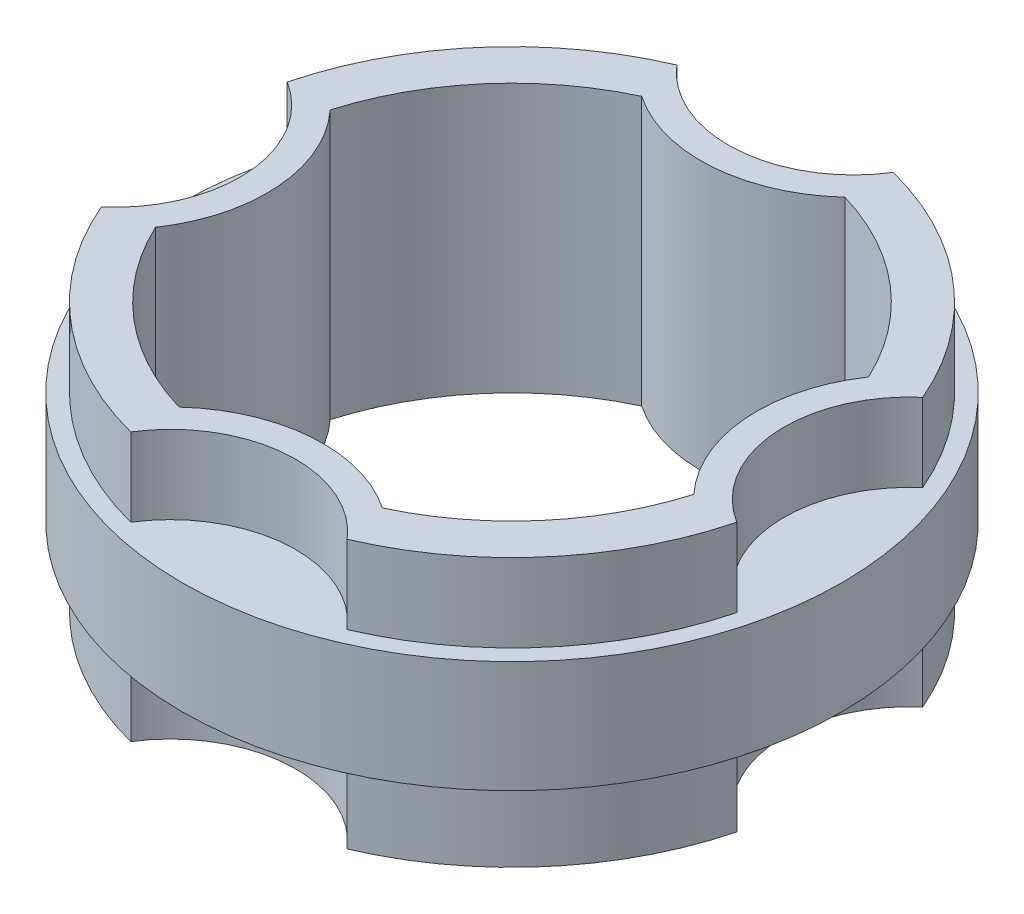
ISO-10303-21;
HEADER;
FILE_DESCRIPTION(('STEP AP214'),'2;1');
FILE_NAME('part.step','',(''),(''),'','','');
FILE_SCHEMA(('AUTOMOTIVE_DESIGN { 1 0 10303 214 1 1 1 1 }'));
ENDSEC;
DATA;
#1=APPLICATION_CONTEXT('core data for automotive mechanical design processes');
#2=APPLICATION_PROTOCOL_DEFINITION('international standard','automotive_design',2000,#1);
#3=PRODUCT_CONTEXT('',#1,'mechanical');
#4=PRODUCT('Part','Part','',(#3));
#5=PRODUCT_RELATED_PRODUCT_CATEGORY('part','',(#4));
#6=PRODUCT_DEFINITION_FORMATION('','',#4);
#7=PRODUCT_DEFINITION_CONTEXT('part definition',#1,'design');
#8=PRODUCT_DEFINITION('design','',#6,#7);
#9=PRODUCT_DEFINITION_SHAPE('','',#8);
#10=(LENGTH_UNIT() NAMED_UNIT(*) SI_UNIT(.MILLI.,.METRE.));
#11=(NAMED_UNIT(*) PLANE_ANGLE_UNIT() SI_UNIT($,.RADIAN.));
#12=(NAMED_UNIT(*) SI_UNIT($,.STERADIAN.) SOLID_ANGLE_UNIT());
#13=UNCERTAINTY_MEASURE_WITH_UNIT(LENGTH_MEASURE(1.E-05),#10,'distance_accuracy_value','');
#14=(GEOMETRIC_REPRESENTATION_CONTEXT(3) GLOBAL_UNCERTAINTY_ASSIGNED_CONTEXT((#13)) GLOBAL_UNIT_ASSIGNED_CONTEXT((#10,
#11,#12)) REPRESENTATION_CONTEXT('',''));
#15=CARTESIAN_POINT('',(0.,0.,0.));
#16=DIRECTION('',(0.,0.,1.));
#17=DIRECTION('',(1.,0.,0.));
#18=AXIS2_PLACEMENT_3D('',#15,#16,#17);
#19=CARTESIAN_POINT('',(104.92721593541,-44.5241872410913,-7.94005837170104));
#20=DIRECTION('',(0.,1.,0.));
#21=DIRECTION('',(0.,0.,1.));
#22=AXIS2_PLACEMENT_3D('',#19,#20,#21);
#23=CYLINDRICAL_SURFACE('',#22,35.5704838142581);
#24=CARTESIAN_POINT('',(104.92721593541,15.875,-7.94005837170104));
#25=DIRECTION('',(0.,1.,0.));
#26=DIRECTION('',(0.,0.,1.));
#27=AXIS2_PLACEMENT_3D('',#24,#25,#26);
#28=CIRCLE('',#27,35.5704838142581);
#29=CARTESIAN_POINT('',(86.0770548694598,15.875,22.225));
#30=VERTEX_POINT('',#29);
#31=CARTESIAN_POINT('',(81.7523967538567,15.875,-34.925));
#32=VERTEX_POINT('',#31);
#33=EDGE_CURVE('E330',#30,#32,#28,.F.);
#34=ORIENTED_EDGE('',*,*,#33,.T.);
#35=DIRECTION('',(0.,1.,0.));
#36=VECTOR('',#35,1.);
#37=CARTESIAN_POINT('',(81.7523967538567,-44.5241872410913,-34.925));
#38=LINE('',#37,#36);
#39=CARTESIAN_POINT('',(81.7523967538567,38.1,-34.925));
#40=VERTEX_POINT('',#39);
#41=EDGE_CURVE('E283',#32,#40,#38,.T.);
#42=ORIENTED_EDGE('',*,*,#41,.T.);
#43=CARTESIAN_POINT('',(104.92721593541,38.1,-7.94005837170104));
#44=DIRECTION('',(0.,1.,0.));
#45=DIRECTION('',(0.,0.,1.));
#46=AXIS2_PLACEMENT_3D('',#43,#44,#45);
#47=CIRCLE('',#46,35.5704838142581);
#48=CARTESIAN_POINT('',(86.0770548694598,38.1,22.225));
#49=VERTEX_POINT('',#48);
#50=EDGE_CURVE('E286',#40,#49,#47,.T.);
#51=ORIENTED_EDGE('',*,*,#50,.T.);
#52=DIRECTION('',(0.,1.,0.));
#53=VECTOR('',#52,1.);
#54=CARTESIAN_POINT('',(86.0770548694598,-44.5241872410913,22.225));
#55=LINE('',#54,#53);
#56=EDGE_CURVE('E280',#30,#49,#55,.T.);
#57=ORIENTED_EDGE('',*,*,#56,.F.);
#58=EDGE_LOOP('',(#34,#42,#51,#57));
#59=FACE_BOUND('',#58,.T.);
#60=ADVANCED_FACE('F39',(#59),#23,.F.);
#61=DIRECTION('',(0.,-1.,0.));
#62=VECTOR('',#61,1.);
#63=CARTESIAN_POINT('',(81.7523967538567,76.2741872410913,-34.925));
#64=LINE('',#63,#62);
#65=CARTESIAN_POINT('',(81.7523967538567,-15.875,-34.925));
#66=VERTEX_POINT('',#65);
#67=CARTESIAN_POINT('',(81.7523967538567,-38.1,-34.925));
#68=VERTEX_POINT('',#67);
#69=EDGE_CURVE('E366',#66,#68,#64,.T.);
#70=ORIENTED_EDGE('',*,*,#69,.F.);
#71=CARTESIAN_POINT('',(104.92721593541,-15.875,-7.94005837170104));
#72=DIRECTION('',(0.,1.,0.));
#73=DIRECTION('',(0.,0.,1.));
#74=AXIS2_PLACEMENT_3D('',#71,#72,#73);
#75=CIRCLE('',#74,35.5704838142581);
#76=CARTESIAN_POINT('',(86.0770548694598,-15.875,22.225));
#77=VERTEX_POINT('',#76);
#78=EDGE_CURVE('E384',#77,#66,#75,.F.);
#79=ORIENTED_EDGE('',*,*,#78,.F.);
#80=DIRECTION('',(0.,-1.,0.));
#81=VECTOR('',#80,1.);
#82=CARTESIAN_POINT('',(86.0770548694598,76.2741872410913,22.225));
#83=LINE('',#82,#81);
#84=CARTESIAN_POINT('',(86.0770548694598,-38.1,22.225));
#85=VERTEX_POINT('',#84);
#86=EDGE_CURVE('E362',#77,#85,#83,.T.);
#87=ORIENTED_EDGE('',*,*,#86,.T.);
#88=CARTESIAN_POINT('',(104.92721593541,-38.1,-7.94005837170104));
#89=DIRECTION('',(0.,1.,0.));
#90=DIRECTION('',(0.,0.,1.));
#91=AXIS2_PLACEMENT_3D('',#88,#89,#90);
#92=CIRCLE('',#91,35.5704838142581);
#93=EDGE_CURVE('E304',#68,#85,#92,.T.);
#94=ORIENTED_EDGE('',*,*,#93,.F.);
#95=EDGE_LOOP('',(#70,#79,#87,#94));
#96=FACE_BOUND('',#95,.T.);
#97=ADVANCED_FACE('F466',(#96),#23,.F.);
#98=CARTESIAN_POINT('',(-7.94005837169994,-44.5241872410913,-104.92721593541));
#99=DIRECTION('',(0.,1.,0.));
#100=DIRECTION('',(0.,0.,1.));
#101=AXIS2_PLACEMENT_3D('',#98,#99,#100);
#102=CYLINDRICAL_SURFACE('',#101,35.5704838142581);
#103=CARTESIAN_POINT('',(-7.94005837169994,15.875,-104.92721593541));
#104=DIRECTION('',(0.,1.,0.));
#105=DIRECTION('',(0.,0.,1.));
#106=AXIS2_PLACEMENT_3D('',#103,#104,#105);
#107=CIRCLE('',#106,35.5704838142581);
#108=CARTESIAN_POINT('',(22.2250000000009,15.875,-86.0770548694596));
#109=VERTEX_POINT('',#108);
#110=CARTESIAN_POINT('',(-34.9249999999991,15.875,-81.7523967538571));
#111=VERTEX_POINT('',#110);
#112=EDGE_CURVE('E375',#109,#111,#107,.F.);
#113=ORIENTED_EDGE('',*,*,#112,.T.);
#114=DIRECTION('',(0.,1.,0.));
#115=VECTOR('',#114,1.);
#116=CARTESIAN_POINT('',(-34.9249999999991,-44.5241872410913,-81.7523967538571));
#117=LINE('',#116,#115);
#118=CARTESIAN_POINT('',(-34.9249999999991,38.1,-81.7523967538571));
#119=VERTEX_POINT('',#118);
#120=EDGE_CURVE('E293',#111,#119,#117,.T.);
#121=ORIENTED_EDGE('',*,*,#120,.T.);
#122=CARTESIAN_POINT('',(-7.94005837169994,38.1,-104.92721593541));
#123=DIRECTION('',(0.,1.,0.));
#124=DIRECTION('',(1.,0.,0.));
#125=AXIS2_PLACEMENT_3D('',#122,#123,#124);
#126=CIRCLE('',#125,35.5704838142581);
#127=CARTESIAN_POINT('',(22.2250000000009,38.1,-86.0770548694596));
#128=VERTEX_POINT('',#127);
#129=EDGE_CURVE('E297',#119,#128,#126,.T.);
#130=ORIENTED_EDGE('',*,*,#129,.T.);
#131=DIRECTION('',(0.,1.,0.));
#132=VECTOR('',#131,1.);
#133=CARTESIAN_POINT('',(22.2250000000009,-44.5241872410913,-86.0770548694596));
#134=LINE('',#133,#132);
#135=EDGE_CURVE('E296',#109,#128,#134,.T.);
#136=ORIENTED_EDGE('',*,*,#135,.F.);
#137=EDGE_LOOP('',(#113,#121,#130,#136));
#138=FACE_BOUND('',#137,.T.);
#139=ADVANCED_FACE('F472',(#138),#102,.F.);
#140=DIRECTION('',(0.,-1.,0.));
#141=VECTOR('',#140,1.);
#142=CARTESIAN_POINT('',(-34.9249999999991,76.2741872410913,-81.7523967538571));
#143=LINE('',#142,#141);
#144=CARTESIAN_POINT('',(-34.9249999999991,-15.875,-81.7523967538571));
#145=VERTEX_POINT('',#144);
#146=CARTESIAN_POINT('',(-34.9249999999991,-38.1,-81.7523967538571));
#147=VERTEX_POINT('',#146);
#148=EDGE_CURVE('E329',#145,#147,#143,.T.);
#149=ORIENTED_EDGE('',*,*,#148,.F.);
#150=CARTESIAN_POINT('',(-7.94005837169994,-15.875,-104.92721593541));
#151=DIRECTION('',(0.,1.,0.));
#152=DIRECTION('',(0.,0.,1.));
#153=AXIS2_PLACEMENT_3D('',#150,#151,#152);
#154=CIRCLE('',#153,35.5704838142581);
#155=CARTESIAN_POINT('',(22.2250000000009,-15.875,-86.0770548694596));
#156=VERTEX_POINT('',#155);
#157=EDGE_CURVE('E387',#156,#145,#154,.F.);
#158=ORIENTED_EDGE('',*,*,#157,.F.);
#159=DIRECTION('',(0.,-1.,0.));
#160=VECTOR('',#159,1.);
#161=CARTESIAN_POINT('',(22.2250000000009,76.2741872410913,-86.0770548694596));
#162=LINE('',#161,#160);
#163=CARTESIAN_POINT('',(22.2250000000009,-38.1,-86.0770548694596));
#164=VERTEX_POINT('',#163);
#165=EDGE_CURVE('E325',#156,#164,#162,.T.);
#166=ORIENTED_EDGE('',*,*,#165,.T.);
#167=CARTESIAN_POINT('',(-7.94005837169994,-38.1,-104.92721593541));
#168=DIRECTION('',(0.,1.,0.));
#169=DIRECTION('',(1.,0.,0.));
#170=AXIS2_PLACEMENT_3D('',#167,#168,#169);
#171=CIRCLE('',#170,35.5704838142581);
#172=EDGE_CURVE('E334',#147,#164,#171,.T.);
#173=ORIENTED_EDGE('',*,*,#172,.F.);
#174=EDGE_LOOP('',(#149,#158,#166,#173));
#175=FACE_BOUND('',#174,.T.);
#176=ADVANCED_FACE('F568',(#175),#102,.F.);
#177=CARTESIAN_POINT('',(-104.92721593541,-44.5241872410913,7.94005837170104));
#178=DIRECTION('',(0.,1.,0.));
#179=DIRECTION('',(0.,0.,1.));
#180=AXIS2_PLACEMENT_3D('',#177,#178,#179);
#181=CYLINDRICAL_SURFACE('',#180,35.5704838142581);
#182=CARTESIAN_POINT('',(-104.92721593541,15.875,7.94005837170104));
#183=DIRECTION('',(0.,1.,0.));
#184=DIRECTION('',(0.,0.,1.));
#185=AXIS2_PLACEMENT_3D('',#182,#183,#184);
#186=CIRCLE('',#185,35.5704838142581);
#187=CARTESIAN_POINT('',(-86.0770548694598,15.875,-22.225));
#188=VERTEX_POINT('',#187);
#189=CARTESIAN_POINT('',(-81.7523967538567,15.875,34.925));
#190=VERTEX_POINT('',#189);
#191=EDGE_CURVE('E378',#188,#190,#186,.F.);
#192=ORIENTED_EDGE('',*,*,#191,.T.);
#193=DIRECTION('',(0.,1.,0.));
#194=VECTOR('',#193,1.);
#195=CARTESIAN_POINT('',(-81.7523967538567,-44.5241872410913,34.925));
#196=LINE('',#195,#194);
#197=CARTESIAN_POINT('',(-81.7523967538567,38.1,34.925));
#198=VERTEX_POINT('',#197);
#199=EDGE_CURVE('E305',#190,#198,#196,.T.);
#200=ORIENTED_EDGE('',*,*,#199,.T.);
#201=CARTESIAN_POINT('',(-104.92721593541,38.1,7.94005837170104));
#202=DIRECTION('',(0.,1.,0.));
#203=DIRECTION('',(0.,0.,-1.));
#204=AXIS2_PLACEMENT_3D('',#201,#202,#203);
#205=CIRCLE('',#204,35.5704838142581);
#206=CARTESIAN_POINT('',(-86.0770548694598,38.1,-22.225));
#207=VERTEX_POINT('',#206);
#208=EDGE_CURVE('E300',#198,#207,#205,.T.);
#209=ORIENTED_EDGE('',*,*,#208,.T.);
#210=DIRECTION('',(0.,1.,0.));
#211=VECTOR('',#210,1.);
#212=CARTESIAN_POINT('',(-86.0770548694598,-44.5241872410913,-22.225));
#213=LINE('',#212,#211);
#214=EDGE_CURVE('E308',#188,#207,#213,.T.);
#215=ORIENTED_EDGE('',*,*,#214,.F.);
#216=EDGE_LOOP('',(#192,#200,#209,#215));
#217=FACE_BOUND('',#216,.T.);
#218=ADVANCED_FACE('F566',(#217),#181,.F.);
#219=DIRECTION('',(0.,-1.,0.));
#220=VECTOR('',#219,1.);
#221=CARTESIAN_POINT('',(-81.7523967538567,76.2741872410913,34.925));
#222=LINE('',#221,#220);
#223=CARTESIAN_POINT('',(-81.7523967538567,-15.875,34.925));
#224=VERTEX_POINT('',#223);
#225=CARTESIAN_POINT('',(-81.7523967538567,-38.1,34.925));
#226=VERTEX_POINT('',#225);
#227=EDGE_CURVE('E342',#224,#226,#222,.T.);
#228=ORIENTED_EDGE('',*,*,#227,.F.);
#229=CARTESIAN_POINT('',(-104.92721593541,-15.875,7.94005837170104));
#230=DIRECTION('',(0.,1.,0.));
#231=DIRECTION('',(0.,0.,1.));
#232=AXIS2_PLACEMENT_3D('',#229,#230,#231);
#233=CIRCLE('',#232,35.5704838142581);
#234=CARTESIAN_POINT('',(-86.0770548694598,-15.875,-22.225));
#235=VERTEX_POINT('',#234);
#236=EDGE_CURVE('E390',#235,#224,#233,.F.);
#237=ORIENTED_EDGE('',*,*,#236,.F.);
#238=DIRECTION('',(0.,-1.,0.));
#239=VECTOR('',#238,1.);
#240=CARTESIAN_POINT('',(-86.0770548694598,76.2741872410913,-22.225));
#241=LINE('',#240,#239);
#242=CARTESIAN_POINT('',(-86.0770548694598,-38.1,-22.225));
#243=VERTEX_POINT('',#242);
#244=EDGE_CURVE('E338',#235,#243,#241,.T.);
#245=ORIENTED_EDGE('',*,*,#244,.T.);
#246=CARTESIAN_POINT('',(-104.92721593541,-38.1,7.94005837170104));
#247=DIRECTION('',(0.,1.,0.));
#248=DIRECTION('',(0.,0.,-1.));
#249=AXIS2_PLACEMENT_3D('',#246,#247,#248);
#250=CIRCLE('',#249,35.5704838142581);
#251=EDGE_CURVE('E346',#226,#243,#250,.T.);
#252=ORIENTED_EDGE('',*,*,#251,.F.);
#253=EDGE_LOOP('',(#228,#237,#245,#252));
#254=FACE_BOUND('',#253,.T.);
#255=ADVANCED_FACE('F519',(#254),#181,.F.);
#256=CARTESIAN_POINT('',(7.94005837170067,-44.5241872410913,104.92721593541));
#257=DIRECTION('',(0.,1.,0.));
#258=DIRECTION('',(0.,0.,1.));
#259=AXIS2_PLACEMENT_3D('',#256,#257,#258);
#260=CYLINDRICAL_SURFACE('',#259,35.5704838142581);
#261=DIRECTION('',(0.,1.,0.));
#262=VECTOR('',#261,1.);
#263=CARTESIAN_POINT('',(-22.2250000000003,-44.5241872410913,86.0770548694597));
#264=LINE('',#263,#262);
#265=CARTESIAN_POINT('',(-22.2250000000003,15.875,86.0770548694597));
#266=VERTEX_POINT('',#265);
#267=CARTESIAN_POINT('',(-22.2250000000003,38.1,86.0770548694597));
#268=VERTEX_POINT('',#267);
#269=EDGE_CURVE('E292',#266,#268,#264,.T.);
#270=ORIENTED_EDGE('',*,*,#269,.F.);
#271=CARTESIAN_POINT('',(7.94005837170067,15.875,104.92721593541));
#272=DIRECTION('',(0.,1.,0.));
#273=DIRECTION('',(0.,0.,1.));
#274=AXIS2_PLACEMENT_3D('',#271,#272,#273);
#275=CIRCLE('',#274,35.5704838142581);
#276=CARTESIAN_POINT('',(34.9249999999997,15.875,81.7523967538568));
#277=VERTEX_POINT('',#276);
#278=EDGE_CURVE('E381',#266,#277,#275,.F.);
#279=ORIENTED_EDGE('',*,*,#278,.T.);
#280=DIRECTION('',(0.,1.,0.));
#281=VECTOR('',#280,1.);
#282=CARTESIAN_POINT('',(34.9249999999997,-44.5241872410913,81.7523967538568));
#283=LINE('',#282,#281);
#284=CARTESIAN_POINT('',(34.9249999999997,38.1,81.7523967538568));
#285=VERTEX_POINT('',#284);
#286=EDGE_CURVE('E316',#277,#285,#283,.T.);
#287=ORIENTED_EDGE('',*,*,#286,.T.);
#288=CARTESIAN_POINT('',(7.94005837170067,38.1,104.92721593541));
#289=DIRECTION('',(0.,1.,0.));
#290=DIRECTION('',(-1.,0.,0.));
#291=AXIS2_PLACEMENT_3D('',#288,#289,#290);
#292=CIRCLE('',#291,35.5704838142581);
#293=EDGE_CURVE('E312',#285,#268,#292,.T.);
#294=ORIENTED_EDGE('',*,*,#293,.T.);
#295=EDGE_LOOP('',(#270,#279,#287,#294));
#296=FACE_BOUND('',#295,.T.);
#297=ADVANCED_FACE('F552',(#296),#260,.F.);
#298=DIRECTION('',(0.,-1.,0.));
#299=VECTOR('',#298,1.);
#300=CARTESIAN_POINT('',(34.9249999999997,76.2741872410913,81.7523967538568));
#301=LINE('',#300,#299);
#302=CARTESIAN_POINT('',(34.9249999999997,-15.875,81.7523967538568));
#303=VERTEX_POINT('',#302);
#304=CARTESIAN_POINT('',(34.9249999999997,-38.1,81.7523967538568));
#305=VERTEX_POINT('',#304);
#306=EDGE_CURVE('E354',#303,#305,#301,.T.);
#307=ORIENTED_EDGE('',*,*,#306,.F.);
#308=CARTESIAN_POINT('',(7.94005837170067,-15.875,104.92721593541));
#309=DIRECTION('',(0.,1.,0.));
#310=DIRECTION('',(0.,0.,1.));
#311=AXIS2_PLACEMENT_3D('',#308,#309,#310);
#312=CIRCLE('',#311,35.5704838142581);
#313=CARTESIAN_POINT('',(-22.2250000000003,-15.875,86.0770548694597));
#314=VERTEX_POINT('',#313);
#315=EDGE_CURVE('E393',#314,#303,#312,.F.);
#316=ORIENTED_EDGE('',*,*,#315,.F.);
#317=DIRECTION('',(0.,-1.,0.));
#318=VECTOR('',#317,1.);
#319=CARTESIAN_POINT('',(-22.2250000000003,76.2741872410913,86.0770548694597));
#320=LINE('',#319,#318);
#321=CARTESIAN_POINT('',(-22.2250000000003,-38.1,86.0770548694597));
#322=VERTEX_POINT('',#321);
#323=EDGE_CURVE('E350',#314,#322,#320,.T.);
#324=ORIENTED_EDGE('',*,*,#323,.T.);
#325=CARTESIAN_POINT('',(7.94005837170067,-38.1,104.92721593541));
#326=DIRECTION('',(0.,1.,0.));
#327=DIRECTION('',(-1.,0.,0.));
#328=AXIS2_PLACEMENT_3D('',#325,#326,#327);
#329=CIRCLE('',#328,35.5704838142581);
#330=EDGE_CURVE('E358',#305,#322,#329,.T.);
#331=ORIENTED_EDGE('',*,*,#330,.F.);
#332=EDGE_LOOP('',(#307,#316,#324,#331));
#333=FACE_BOUND('',#332,.T.);
#334=ADVANCED_FACE('F492',(#333),#260,.F.);
#335=CARTESIAN_POINT('',(0.,38.1,0.));
#336=DIRECTION('',(0.,-1.,0.));
#337=DIRECTION('',(0.,0.,-1.));
#338=AXIS2_PLACEMENT_3D('',#335,#336,#337);
#339=CYLINDRICAL_SURFACE('',#338,76.2);
#340=CARTESIAN_POINT('',(0.,38.1,0.));
#341=DIRECTION('',(0.,1.,0.));
#342=DIRECTION('',(0.,0.,1.));
#343=AXIS2_PLACEMENT_3D('',#340,#341,#342);
#344=CIRCLE('',#343,76.2);
#345=CARTESIAN_POINT('',(32.221294795127,38.1,69.0523581184996));
#346=VERTEX_POINT('',#345);
#347=CARTESIAN_POINT('',(73.1147754744554,38.1,21.4632152139417));
#348=VERTEX_POINT('',#347);
#349=EDGE_CURVE('E231',#346,#348,#344,.T.);
#350=ORIENTED_EDGE('',*,*,#349,.T.);
#351=DIRECTION('',(0.,-1.,0.));
#352=VECTOR('',#351,1.);
#353=CARTESIAN_POINT('',(73.1147754744554,0.,21.4632152139417));
#354=LINE('',#353,#352);
#355=CARTESIAN_POINT('',(73.1147754744554,-38.1,21.4632152139417));
#356=VERTEX_POINT('',#355);
#357=EDGE_CURVE('E207',#348,#356,#354,.T.);
#358=ORIENTED_EDGE('',*,*,#357,.T.);
#359=CARTESIAN_POINT('',(0.,-38.1,0.));
#360=DIRECTION('',(0.,1.,0.));
#361=DIRECTION('',(0.,0.,1.));
#362=AXIS2_PLACEMENT_3D('',#359,#360,#361);
#363=CIRCLE('',#362,76.2);
#364=CARTESIAN_POINT('',(32.221294795127,-38.1,69.0523581184996));
#365=VERTEX_POINT('',#364);
#366=EDGE_CURVE('E239',#365,#356,#363,.T.);
#367=ORIENTED_EDGE('',*,*,#366,.F.);
#368=DIRECTION('',(0.,-1.,0.));
#369=VECTOR('',#368,1.);
#370=CARTESIAN_POINT('',(32.221294795127,0.,69.0523581184996));
#371=LINE('',#370,#369);
#372=EDGE_CURVE('E400',#365,#346,#371,.F.);
#373=ORIENTED_EDGE('',*,*,#372,.T.);
#374=EDGE_LOOP('',(#350,#358,#367,#373));
#375=FACE_BOUND('',#374,.T.);
#376=ADVANCED_FACE('F440',(#375),#339,.F.);
#377=CARTESIAN_POINT('',(69.0523581185,-38.1,-32.2212947951263));
#378=VERTEX_POINT('',#377);
#379=CARTESIAN_POINT('',(21.463215213941,-38.1,-73.1147754744556));
#380=VERTEX_POINT('',#379);
#381=EDGE_CURVE('E219',#378,#380,#363,.T.);
#382=ORIENTED_EDGE('',*,*,#381,.F.);
#383=DIRECTION('',(0.,-1.,0.));
#384=VECTOR('',#383,1.);
#385=CARTESIAN_POINT('',(69.0523581185,0.,-32.2212947951263));
#386=LINE('',#385,#384);
#387=CARTESIAN_POINT('',(69.0523581185,38.1,-32.2212947951263));
#388=VERTEX_POINT('',#387);
#389=EDGE_CURVE('E204',#378,#388,#386,.F.);
#390=ORIENTED_EDGE('',*,*,#389,.T.);
#391=CARTESIAN_POINT('',(21.463215213941,38.1,-73.1147754744556));
#392=VERTEX_POINT('',#391);
#393=EDGE_CURVE('E217',#388,#392,#344,.T.);
#394=ORIENTED_EDGE('',*,*,#393,.T.);
#395=DIRECTION('',(0.,-1.,0.));
#396=VECTOR('',#395,1.);
#397=CARTESIAN_POINT('',(21.463215213941,0.,-73.1147754744556));
#398=LINE('',#397,#396);
#399=EDGE_CURVE('E423',#392,#380,#398,.T.);
#400=ORIENTED_EDGE('',*,*,#399,.T.);
#401=EDGE_LOOP('',(#382,#390,#394,#400));
#402=FACE_BOUND('',#401,.T.);
#403=ADVANCED_FACE('F215',(#402),#339,.F.);
#404=CARTESIAN_POINT('',(-32.221294795127,-38.1,-69.0523581184996));
#405=VERTEX_POINT('',#404);
#406=CARTESIAN_POINT('',(-73.1147754744555,-38.1,-21.4632152139412));
#407=VERTEX_POINT('',#406);
#408=EDGE_CURVE('E247',#405,#407,#363,.T.);
#409=ORIENTED_EDGE('',*,*,#408,.F.);
#410=DIRECTION('',(0.,-1.,0.));
#411=VECTOR('',#410,1.);
#412=CARTESIAN_POINT('',(-32.221294795127,0.,-69.0523581184996));
#413=LINE('',#412,#411);
#414=CARTESIAN_POINT('',(-32.221294795127,38.1,-69.0523581184996));
#415=VERTEX_POINT('',#414);
#416=EDGE_CURVE('E429',#405,#415,#413,.F.);
#417=ORIENTED_EDGE('',*,*,#416,.T.);
#418=CARTESIAN_POINT('',(-73.1147754744555,38.1,-21.4632152139412));
#419=VERTEX_POINT('',#418);
#420=EDGE_CURVE('E229',#415,#419,#344,.T.);
#421=ORIENTED_EDGE('',*,*,#420,.T.);
#422=DIRECTION('',(0.,-1.,0.));
#423=VECTOR('',#422,1.);
#424=CARTESIAN_POINT('',(-73.1147754744555,0.,-21.4632152139412));
#425=LINE('',#424,#423);
#426=EDGE_CURVE('E407',#419,#407,#425,.T.);
#427=ORIENTED_EDGE('',*,*,#426,.T.);
#428=EDGE_LOOP('',(#409,#417,#421,#427));
#429=FACE_BOUND('',#428,.T.);
#430=ADVANCED_FACE('F454',(#429),#339,.F.);
#431=CARTESIAN_POINT('',(-69.0523581184998,-38.1,32.2212947951267));
#432=VERTEX_POINT('',#431);
#433=CARTESIAN_POINT('',(-21.463215213941,-38.1,73.1147754744556));
#434=VERTEX_POINT('',#433);
#435=EDGE_CURVE('E244',#432,#434,#363,.T.);
#436=ORIENTED_EDGE('',*,*,#435,.F.);
#437=DIRECTION('',(0.,-1.,0.));
#438=VECTOR('',#437,1.);
#439=CARTESIAN_POINT('',(-69.0523581184997,0.,32.2212947951268));
#440=LINE('',#439,#438);
#441=CARTESIAN_POINT('',(-69.0523581184997,38.1,32.2212947951268));
#442=VERTEX_POINT('',#441);
#443=EDGE_CURVE('E414',#432,#442,#440,.F.);
#444=ORIENTED_EDGE('',*,*,#443,.T.);
#445=CARTESIAN_POINT('',(-21.463215213941,38.1,73.1147754744556));
#446=VERTEX_POINT('',#445);
#447=EDGE_CURVE('E235',#442,#446,#344,.T.);
#448=ORIENTED_EDGE('',*,*,#447,.T.);
#449=DIRECTION('',(0.,-1.,0.));
#450=VECTOR('',#449,1.);
#451=CARTESIAN_POINT('',(-21.463215213941,0.,73.1147754744556));
#452=LINE('',#451,#450);
#453=EDGE_CURVE('E396',#446,#434,#452,.T.);
#454=ORIENTED_EDGE('',*,*,#453,.T.);
#455=EDGE_LOOP('',(#436,#444,#448,#454));
#456=FACE_BOUND('',#455,.T.);
#457=ADVANCED_FACE('F447',(#456),#339,.F.);
#458=CARTESIAN_POINT('',(0.,38.1,0.));
#459=DIRECTION('',(0.,-1.,0.));
#460=DIRECTION('',(0.,0.,-1.));
#461=AXIS2_PLACEMENT_3D('',#458,#459,#460);
#462=CYLINDRICAL_SURFACE('',#461,88.9);
#463=ORIENTED_EDGE('',*,*,#86,.F.);
#464=CARTESIAN_POINT('',(0.,-15.875,0.));
#465=DIRECTION('',(0.,1.,0.));
#466=DIRECTION('',(0.,0.,1.));
#467=AXIS2_PLACEMENT_3D('',#464,#465,#466);
#468=CIRCLE('',#467,88.9);
#469=EDGE_CURVE('E11',#303,#77,#468,.T.);
#470=ORIENTED_EDGE('',*,*,#469,.F.);
#471=ORIENTED_EDGE('',*,*,#306,.T.);
#472=CARTESIAN_POINT('',(0.,-38.1,0.));
#473=DIRECTION('',(0.,1.,0.));
#474=DIRECTION('',(0.,0.,1.));
#475=AXIS2_PLACEMENT_3D('',#472,#473,#474);
#476=CIRCLE('',#475,88.9);
#477=EDGE_CURVE('E43',#305,#85,#476,.T.);
#478=ORIENTED_EDGE('',*,*,#477,.T.);
#479=EDGE_LOOP('',(#463,#470,#471,#478));
#480=FACE_BOUND('',#479,.T.);
#481=ADVANCED_FACE('F500',(#480),#462,.T.);
#482=EDGE_CURVE('E503',#68,#164,#476,.T.);
#483=ORIENTED_EDGE('',*,*,#482,.T.);
#484=ORIENTED_EDGE('',*,*,#165,.F.);
#485=EDGE_CURVE('E49',#66,#156,#468,.T.);
#486=ORIENTED_EDGE('',*,*,#485,.F.);
#487=ORIENTED_EDGE('',*,*,#69,.T.);
#488=EDGE_LOOP('',(#483,#484,#486,#487));
#489=FACE_BOUND('',#488,.T.);
#490=ADVANCED_FACE('F722',(#489),#462,.T.);
#491=EDGE_CURVE('E228',#226,#322,#476,.T.);
#492=ORIENTED_EDGE('',*,*,#491,.T.);
#493=ORIENTED_EDGE('',*,*,#323,.F.);
#494=EDGE_CURVE('E51',#224,#314,#468,.T.);
#495=ORIENTED_EDGE('',*,*,#494,.F.);
#496=ORIENTED_EDGE('',*,*,#227,.T.);
#497=EDGE_LOOP('',(#492,#493,#495,#496));
#498=FACE_BOUND('',#497,.T.);
#499=ADVANCED_FACE('F523',(#498),#462,.T.);
#500=EDGE_CURVE('E234',#147,#243,#476,.T.);
#501=ORIENTED_EDGE('',*,*,#500,.T.);
#502=ORIENTED_EDGE('',*,*,#244,.F.);
#503=EDGE_CURVE('E532',#145,#235,#468,.T.);
#504=ORIENTED_EDGE('',*,*,#503,.F.);
#505=ORIENTED_EDGE('',*,*,#148,.T.);
#506=EDGE_LOOP('',(#501,#502,#504,#505));
#507=FACE_BOUND('',#506,.T.);
#508=ADVANCED_FACE('F481',(#507),#462,.T.);
#509=CARTESIAN_POINT('',(0.,15.875,0.));
#510=DIRECTION('',(0.,1.,0.));
#511=DIRECTION('',(0.,0.,1.));
#512=AXIS2_PLACEMENT_3D('',#509,#510,#511);
#513=PLANE('',#512);
#514=CARTESIAN_POINT('',(0.,15.875,0.));
#515=DIRECTION('',(0.,1.,0.));
#516=DIRECTION('',(0.,0.,1.));
#517=AXIS2_PLACEMENT_3D('',#514,#515,#516);
#518=CIRCLE('',#517,93.6625);
#519=CARTESIAN_POINT('',(0.,15.875,93.6625));
#520=VERTEX_POINT('',#519);
#521=EDGE_CURVE('E264',#520,#520,#518,.T.);
#522=ORIENTED_EDGE('',*,*,#521,.T.);
#523=EDGE_LOOP('',(#522));
#524=FACE_BOUND('',#523,.T.);
#525=CARTESIAN_POINT('',(0.,15.875,0.));
#526=DIRECTION('',(0.,1.,0.));
#527=DIRECTION('',(0.,0.,1.));
#528=AXIS2_PLACEMENT_3D('',#525,#526,#527);
#529=CIRCLE('',#528,88.9);
#530=EDGE_CURVE('E249',#32,#109,#529,.T.);
#531=ORIENTED_EDGE('',*,*,#530,.F.);
#532=ORIENTED_EDGE('',*,*,#33,.F.);
#533=EDGE_CURVE('E255',#277,#30,#529,.T.);
#534=ORIENTED_EDGE('',*,*,#533,.F.);
#535=ORIENTED_EDGE('',*,*,#278,.F.);
#536=EDGE_CURVE('E262',#190,#266,#529,.T.);
#537=ORIENTED_EDGE('',*,*,#536,.F.);
#538=ORIENTED_EDGE('',*,*,#191,.F.);
#539=EDGE_CURVE('E254',#111,#188,#529,.T.);
#540=ORIENTED_EDGE('',*,*,#539,.F.);
#541=ORIENTED_EDGE('',*,*,#112,.F.);
#542=EDGE_LOOP('',(#531,#532,#534,#535,#537,#538,#540,#541));
#543=FACE_BOUND('',#542,.T.);
#544=ADVANCED_FACE('F477',(#524,#543),#513,.T.);
#545=ORIENTED_EDGE('',*,*,#536,.T.);
#546=ORIENTED_EDGE('',*,*,#269,.T.);
#547=CARTESIAN_POINT('',(0.,38.1,0.));
#548=DIRECTION('',(0.,1.,0.));
#549=DIRECTION('',(0.,0.,1.));
#550=AXIS2_PLACEMENT_3D('',#547,#548,#549);
#551=CIRCLE('',#550,88.9);
#552=EDGE_CURVE('E541',#198,#268,#551,.T.);
#553=ORIENTED_EDGE('',*,*,#552,.F.);
#554=ORIENTED_EDGE('',*,*,#199,.F.);
#555=EDGE_LOOP('',(#545,#546,#553,#554));
#556=FACE_BOUND('',#555,.T.);
#557=ADVANCED_FACE('F480',(#556),#462,.T.);
#558=ORIENTED_EDGE('',*,*,#539,.T.);
#559=ORIENTED_EDGE('',*,*,#214,.T.);
#560=EDGE_CURVE('E536',#119,#207,#551,.T.);
#561=ORIENTED_EDGE('',*,*,#560,.F.);
#562=ORIENTED_EDGE('',*,*,#120,.F.);
#563=EDGE_LOOP('',(#558,#559,#561,#562));
#564=FACE_BOUND('',#563,.T.);
#565=ADVANCED_FACE('F563',(#564),#462,.T.);
#566=ORIENTED_EDGE('',*,*,#530,.T.);
#567=ORIENTED_EDGE('',*,*,#135,.T.);
#568=EDGE_CURVE('E533',#40,#128,#551,.T.);
#569=ORIENTED_EDGE('',*,*,#568,.F.);
#570=ORIENTED_EDGE('',*,*,#41,.F.);
#571=EDGE_LOOP('',(#566,#567,#569,#570));
#572=FACE_BOUND('',#571,.T.);
#573=ADVANCED_FACE('F495',(#572),#462,.T.);
#574=CARTESIAN_POINT('',(0.,38.1,0.));
#575=DIRECTION('',(0.,1.,0.));
#576=DIRECTION('',(0.,0.,1.));
#577=AXIS2_PLACEMENT_3D('',#574,#575,#576);
#578=PLANE('',#577);
#579=ORIENTED_EDGE('',*,*,#393,.F.);
#580=CARTESIAN_POINT('',(104.92721593541,38.1,-7.94005837169957));
#581=DIRECTION('',(0.,1.,0.));
#582=DIRECTION('',(1.,0.,0.));
#583=AXIS2_PLACEMENT_3D('',#580,#581,#582);
#584=CIRCLE('',#583,43.3195552335648);
#585=EDGE_CURVE('E201',#388,#348,#584,.T.);
#586=ORIENTED_EDGE('',*,*,#585,.T.);
#587=ORIENTED_EDGE('',*,*,#349,.F.);
#588=CARTESIAN_POINT('',(7.94005837170067,38.1,104.92721593541));
#589=DIRECTION('',(0.,1.,0.));
#590=DIRECTION('',(0.,0.,1.));
#591=AXIS2_PLACEMENT_3D('',#588,#589,#590);
#592=CIRCLE('',#591,43.3195552335648);
#593=EDGE_CURVE('E403',#346,#446,#592,.T.);
#594=ORIENTED_EDGE('',*,*,#593,.T.);
#595=ORIENTED_EDGE('',*,*,#447,.F.);
#596=CARTESIAN_POINT('',(-104.92721593541,38.1,7.94005837170031));
#597=DIRECTION('',(0.,1.,0.));
#598=DIRECTION('',(-1.,0.,0.));
#599=AXIS2_PLACEMENT_3D('',#596,#597,#598);
#600=CIRCLE('',#599,43.3195552335648);
#601=EDGE_CURVE('E418',#442,#419,#600,.T.);
#602=ORIENTED_EDGE('',*,*,#601,.T.);
#603=ORIENTED_EDGE('',*,*,#420,.F.);
#604=CARTESIAN_POINT('',(-7.94005837170067,38.1,-104.92721593541));
#605=DIRECTION('',(0.,1.,0.));
#606=DIRECTION('',(0.,0.,-1.));
#607=AXIS2_PLACEMENT_3D('',#604,#605,#606);
#608=CIRCLE('',#607,43.3195552335648);
#609=EDGE_CURVE('E226',#415,#392,#608,.T.);
#610=ORIENTED_EDGE('',*,*,#609,.T.);
#611=EDGE_LOOP('',(#579,#586,#587,#594,#595,#602,#603,#610));
#612=FACE_BOUND('',#611,.T.);
#613=ORIENTED_EDGE('',*,*,#568,.T.);
#614=ORIENTED_EDGE('',*,*,#129,.F.);
#615=ORIENTED_EDGE('',*,*,#560,.T.);
#616=ORIENTED_EDGE('',*,*,#208,.F.);
#617=ORIENTED_EDGE('',*,*,#552,.T.);
#618=ORIENTED_EDGE('',*,*,#293,.F.);
#619=EDGE_CURVE('E511',#285,#49,#551,.T.);
#620=ORIENTED_EDGE('',*,*,#619,.T.);
#621=ORIENTED_EDGE('',*,*,#50,.F.);
#622=EDGE_LOOP('',(#613,#614,#615,#616,#617,#618,#620,#621));
#623=FACE_BOUND('',#622,.T.);
#624=ADVANCED_FACE('F223',(#612,#623),#578,.T.);
#625=CARTESIAN_POINT('',(0.,-38.1,0.));
#626=DIRECTION('',(0.,1.,0.));
#627=DIRECTION('',(0.,0.,1.));
#628=AXIS2_PLACEMENT_3D('',#625,#626,#627);
#629=PLANE('',#628);
#630=CARTESIAN_POINT('',(104.92721593541,-38.1,-7.94005837169957));
#631=DIRECTION('',(0.,1.,0.));
#632=DIRECTION('',(1.,0.,0.));
#633=AXIS2_PLACEMENT_3D('',#630,#631,#632);
#634=CIRCLE('',#633,43.3195552335648);
#635=EDGE_CURVE('E58',#378,#356,#634,.T.);
#636=ORIENTED_EDGE('',*,*,#635,.F.);
#637=ORIENTED_EDGE('',*,*,#381,.T.);
#638=CARTESIAN_POINT('',(-7.94005837170067,-38.1,-104.92721593541));
#639=DIRECTION('',(0.,1.,0.));
#640=DIRECTION('',(0.,0.,-1.));
#641=AXIS2_PLACEMENT_3D('',#638,#639,#640);
#642=CIRCLE('',#641,43.3195552335648);
#643=EDGE_CURVE('E64',#405,#380,#642,.T.);
#644=ORIENTED_EDGE('',*,*,#643,.F.);
#645=ORIENTED_EDGE('',*,*,#408,.T.);
#646=CARTESIAN_POINT('',(-104.92721593541,-38.1,7.94005837170031));
#647=DIRECTION('',(0.,1.,0.));
#648=DIRECTION('',(-1.,0.,0.));
#649=AXIS2_PLACEMENT_3D('',#646,#647,#648);
#650=CIRCLE('',#649,43.3195552335648);
#651=EDGE_CURVE('E419',#432,#407,#650,.T.);
#652=ORIENTED_EDGE('',*,*,#651,.F.);
#653=ORIENTED_EDGE('',*,*,#435,.T.);
#654=CARTESIAN_POINT('',(7.94005837170067,-38.1,104.92721593541));
#655=DIRECTION('',(0.,1.,0.));
#656=DIRECTION('',(0.,0.,1.));
#657=AXIS2_PLACEMENT_3D('',#654,#655,#656);
#658=CIRCLE('',#657,43.3195552335648);
#659=EDGE_CURVE('E404',#365,#434,#658,.T.);
#660=ORIENTED_EDGE('',*,*,#659,.F.);
#661=ORIENTED_EDGE('',*,*,#366,.T.);
#662=EDGE_LOOP('',(#636,#637,#644,#645,#652,#653,#660,#661));
#663=FACE_BOUND('',#662,.T.);
#664=ORIENTED_EDGE('',*,*,#482,.F.);
#665=ORIENTED_EDGE('',*,*,#93,.T.);
#666=ORIENTED_EDGE('',*,*,#477,.F.);
#667=ORIENTED_EDGE('',*,*,#330,.T.);
#668=ORIENTED_EDGE('',*,*,#491,.F.);
#669=ORIENTED_EDGE('',*,*,#251,.T.);
#670=ORIENTED_EDGE('',*,*,#500,.F.);
#671=ORIENTED_EDGE('',*,*,#172,.T.);
#672=EDGE_LOOP('',(#664,#665,#666,#667,#668,#669,#670,#671));
#673=FACE_BOUND('',#672,.T.);
#674=ADVANCED_FACE('F494',(#663,#673),#629,.F.);
#675=ORIENTED_EDGE('',*,*,#56,.T.);
#676=ORIENTED_EDGE('',*,*,#619,.F.);
#677=ORIENTED_EDGE('',*,*,#286,.F.);
#678=ORIENTED_EDGE('',*,*,#533,.T.);
#679=EDGE_LOOP('',(#675,#676,#677,#678));
#680=FACE_BOUND('',#679,.T.);
#681=ADVANCED_FACE('F41',(#680),#462,.T.);
#682=CARTESIAN_POINT('',(0.,-15.875,0.));
#683=DIRECTION('',(0.,1.,0.));
#684=DIRECTION('',(0.,0.,1.));
#685=AXIS2_PLACEMENT_3D('',#682,#683,#684);
#686=PLANE('',#685);
#687=CARTESIAN_POINT('',(0.,-15.875,0.));
#688=DIRECTION('',(0.,1.,0.));
#689=DIRECTION('',(0.,0.,1.));
#690=AXIS2_PLACEMENT_3D('',#687,#688,#689);
#691=CIRCLE('',#690,93.6625);
#692=CARTESIAN_POINT('',(0.,-15.875,93.6625));
#693=VERTEX_POINT('',#692);
#694=EDGE_CURVE('E274',#693,#693,#691,.T.);
#695=ORIENTED_EDGE('',*,*,#694,.F.);
#696=EDGE_LOOP('',(#695));
#697=FACE_BOUND('',#696,.T.);
#698=ORIENTED_EDGE('',*,*,#469,.T.);
#699=ORIENTED_EDGE('',*,*,#78,.T.);
#700=ORIENTED_EDGE('',*,*,#485,.T.);
#701=ORIENTED_EDGE('',*,*,#157,.T.);
#702=ORIENTED_EDGE('',*,*,#503,.T.);
#703=ORIENTED_EDGE('',*,*,#236,.T.);
#704=ORIENTED_EDGE('',*,*,#494,.T.);
#705=ORIENTED_EDGE('',*,*,#315,.T.);
#706=EDGE_LOOP('',(#698,#699,#700,#701,#702,#703,#704,#705));
#707=FACE_BOUND('',#706,.T.);
#708=ADVANCED_FACE('F482',(#697,#707),#686,.F.);
#709=CARTESIAN_POINT('',(0.,15.875,0.));
#710=DIRECTION('',(0.,-1.,0.));
#711=DIRECTION('',(0.,0.,-1.));
#712=AXIS2_PLACEMENT_3D('',#709,#710,#711);
#713=CYLINDRICAL_SURFACE('',#712,93.6625);
#714=ORIENTED_EDGE('',*,*,#521,.F.);
#715=EDGE_LOOP('',(#714));
#716=FACE_BOUND('',#715,.T.);
#717=ORIENTED_EDGE('',*,*,#694,.T.);
#718=EDGE_LOOP('',(#717));
#719=FACE_BOUND('',#718,.T.);
#720=ADVANCED_FACE('F485',(#716,#719),#713,.T.);
#721=CARTESIAN_POINT('',(7.94005837170067,38.1,104.92721593541));
#722=DIRECTION('',(0.,-1.,0.));
#723=DIRECTION('',(0.,0.,-1.));
#724=AXIS2_PLACEMENT_3D('',#721,#722,#723);
#725=CYLINDRICAL_SURFACE('',#724,43.3195552335648);
#726=ORIENTED_EDGE('',*,*,#453,.F.);
#727=ORIENTED_EDGE('',*,*,#593,.F.);
#728=ORIENTED_EDGE('',*,*,#372,.F.);
#729=ORIENTED_EDGE('',*,*,#659,.T.);
#730=EDGE_LOOP('',(#726,#727,#728,#729));
#731=FACE_BOUND('',#730,.T.);
#732=ADVANCED_FACE('F445',(#731),#725,.T.);
#733=CARTESIAN_POINT('',(-104.92721593541,38.1,7.94005837170031));
#734=DIRECTION('',(0.,-1.,0.));
#735=DIRECTION('',(0.,0.,-1.));
#736=AXIS2_PLACEMENT_3D('',#733,#734,#735);
#737=CYLINDRICAL_SURFACE('',#736,43.3195552335648);
#738=ORIENTED_EDGE('',*,*,#426,.F.);
#739=ORIENTED_EDGE('',*,*,#601,.F.);
#740=ORIENTED_EDGE('',*,*,#443,.F.);
#741=ORIENTED_EDGE('',*,*,#651,.T.);
#742=EDGE_LOOP('',(#738,#739,#740,#741));
#743=FACE_BOUND('',#742,.T.);
#744=ADVANCED_FACE('F451',(#743),#737,.T.);
#745=CARTESIAN_POINT('',(-7.94005837170067,38.1,-104.92721593541));
#746=DIRECTION('',(0.,-1.,0.));
#747=DIRECTION('',(0.,0.,-1.));
#748=AXIS2_PLACEMENT_3D('',#745,#746,#747);
#749=CYLINDRICAL_SURFACE('',#748,43.3195552335648);
#750=ORIENTED_EDGE('',*,*,#399,.F.);
#751=ORIENTED_EDGE('',*,*,#609,.F.);
#752=ORIENTED_EDGE('',*,*,#416,.F.);
#753=ORIENTED_EDGE('',*,*,#643,.T.);
#754=EDGE_LOOP('',(#750,#751,#752,#753));
#755=FACE_BOUND('',#754,.T.);
#756=ADVANCED_FACE('F456',(#755),#749,.T.);
#757=CARTESIAN_POINT('',(104.92721593541,38.1,-7.94005837169957));
#758=DIRECTION('',(0.,-1.,0.));
#759=DIRECTION('',(0.,0.,-1.));
#760=AXIS2_PLACEMENT_3D('',#757,#758,#759);
#761=CYLINDRICAL_SURFACE('',#760,43.3195552335648);
#762=ORIENTED_EDGE('',*,*,#357,.F.);
#763=ORIENTED_EDGE('',*,*,#585,.F.);
#764=ORIENTED_EDGE('',*,*,#389,.F.);
#765=ORIENTED_EDGE('',*,*,#635,.T.);
#766=EDGE_LOOP('',(#762,#763,#764,#765));
#767=FACE_BOUND('',#766,.T.);
#768=ADVANCED_FACE('F203',(#767),#761,.T.);
#769=CLOSED_SHELL('',(#60,#97,#139,#176,#218,#255,#297,#334,#376,#403,#430,#457,#481,#490,#499,
#508,#544,#557,#565,#573,#624,#674,#681,#708,#720,#732,#744,#756,#768));
#770=MANIFOLD_SOLID_BREP('B2',#769);
#771=ADVANCED_BREP_SHAPE_REPRESENTATION('',(#18,#770),#14);
#772=SHAPE_DEFINITION_REPRESENTATION(#9,#771);
ENDSEC;
END-ISO-10303-21;
